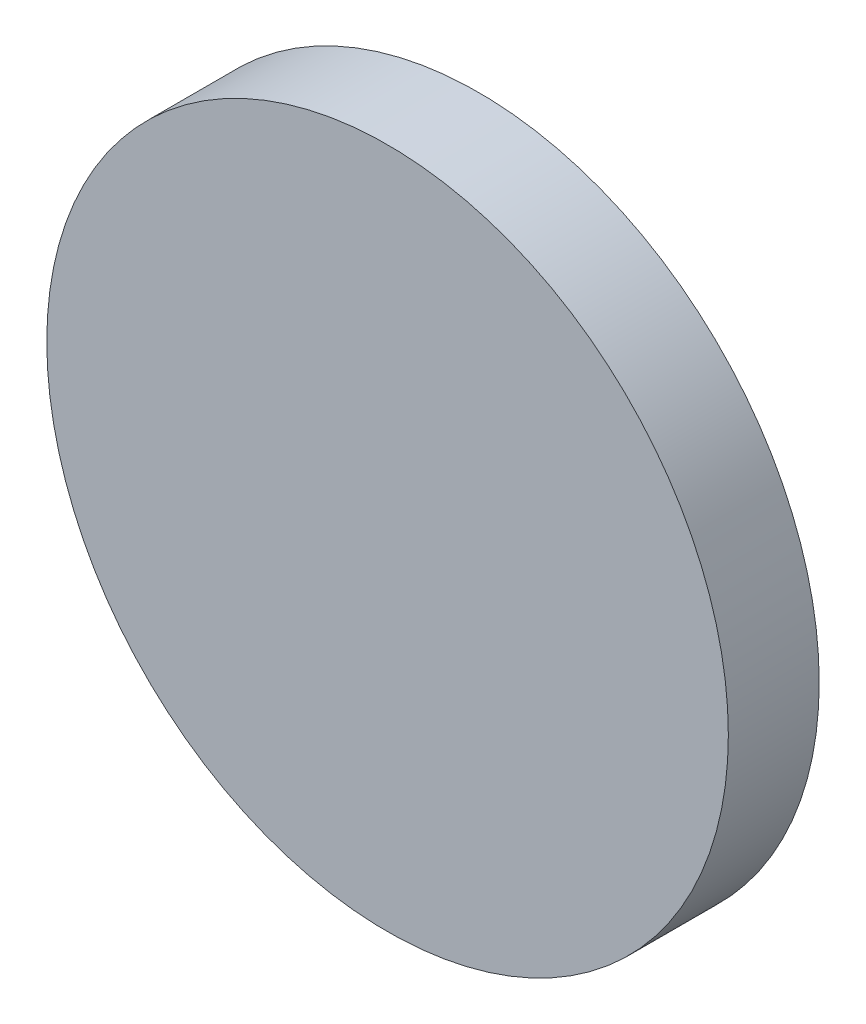
ISO-10303-21;
HEADER;
FILE_DESCRIPTION(('STEP AP214'),'2;1');
FILE_NAME('part.step','',(''),(''),'','','');
FILE_SCHEMA(('AUTOMOTIVE_DESIGN { 1 0 10303 214 1 1 1 1 }'));
ENDSEC;
DATA;
#1=APPLICATION_CONTEXT('core data for automotive mechanical design processes');
#2=APPLICATION_PROTOCOL_DEFINITION('international standard','automotive_design',2000,#1);
#3=PRODUCT_CONTEXT('',#1,'mechanical');
#4=PRODUCT('Part','Part','',(#3));
#5=PRODUCT_RELATED_PRODUCT_CATEGORY('part','',(#4));
#6=PRODUCT_DEFINITION_FORMATION('','',#4);
#7=PRODUCT_DEFINITION_CONTEXT('part definition',#1,'design');
#8=PRODUCT_DEFINITION('design','',#6,#7);
#9=PRODUCT_DEFINITION_SHAPE('','',#8);
#10=(LENGTH_UNIT() NAMED_UNIT(*) SI_UNIT(.MILLI.,.METRE.));
#11=(NAMED_UNIT(*) PLANE_ANGLE_UNIT() SI_UNIT($,.RADIAN.));
#12=(NAMED_UNIT(*) SI_UNIT($,.STERADIAN.) SOLID_ANGLE_UNIT());
#13=UNCERTAINTY_MEASURE_WITH_UNIT(LENGTH_MEASURE(1.E-05),#10,'distance_accuracy_value','');
#14=(GEOMETRIC_REPRESENTATION_CONTEXT(3) GLOBAL_UNCERTAINTY_ASSIGNED_CONTEXT((#13)) GLOBAL_UNIT_ASSIGNED_CONTEXT((#10,
#11,#12)) REPRESENTATION_CONTEXT('',''));
#15=CARTESIAN_POINT('',(0.,0.,0.));
#16=DIRECTION('',(0.,0.,1.));
#17=DIRECTION('',(1.,0.,0.));
#18=AXIS2_PLACEMENT_3D('',#15,#16,#17);
#19=CARTESIAN_POINT('',(0.,0.,20.));
#20=DIRECTION('',(0.,0.,-1.));
#21=DIRECTION('',(-1.,0.,0.));
#22=AXIS2_PLACEMENT_3D('',#19,#20,#21);
#23=CYLINDRICAL_SURFACE('',#22,75.);
#24=CARTESIAN_POINT('',(0.,0.,20.));
#25=DIRECTION('',(0.,0.,1.));
#26=DIRECTION('',(1.,0.,0.));
#27=AXIS2_PLACEMENT_3D('',#24,#25,#26);
#28=CIRCLE('',#27,75.);
#29=CARTESIAN_POINT('',(75.,0.,20.));
#30=VERTEX_POINT('',#29);
#31=EDGE_CURVE('E10',#30,#30,#28,.T.);
#32=ORIENTED_EDGE('',*,*,#31,.F.);
#33=EDGE_LOOP('',(#32));
#34=FACE_BOUND('',#33,.T.);
#35=CARTESIAN_POINT('',(0.,0.,0.));
#36=DIRECTION('',(0.,0.,1.));
#37=DIRECTION('',(1.,0.,0.));
#38=AXIS2_PLACEMENT_3D('',#35,#36,#37);
#39=CIRCLE('',#38,75.);
#40=CARTESIAN_POINT('',(75.,0.,0.));
#41=VERTEX_POINT('',#40);
#42=EDGE_CURVE('E38',#41,#41,#39,.T.);
#43=ORIENTED_EDGE('',*,*,#42,.T.);
#44=EDGE_LOOP('',(#43));
#45=FACE_BOUND('',#44,.T.);
#46=ADVANCED_FACE('F35',(#34,#45),#23,.T.);
#47=CARTESIAN_POINT('',(0.,0.,20.));
#48=DIRECTION('',(0.,0.,1.));
#49=DIRECTION('',(1.,0.,0.));
#50=AXIS2_PLACEMENT_3D('',#47,#48,#49);
#51=PLANE('',#50);
#52=ORIENTED_EDGE('',*,*,#31,.T.);
#53=EDGE_LOOP('',(#52));
#54=FACE_BOUND('',#53,.T.);
#55=ADVANCED_FACE('F50',(#54),#51,.T.);
#56=CARTESIAN_POINT('',(0.,0.,0.));
#57=DIRECTION('',(0.,0.,1.));
#58=DIRECTION('',(1.,0.,0.));
#59=AXIS2_PLACEMENT_3D('',#56,#57,#58);
#60=PLANE('',#59);
#61=ORIENTED_EDGE('',*,*,#42,.F.);
#62=EDGE_LOOP('',(#61));
#63=FACE_BOUND('',#62,.T.);
#64=ADVANCED_FACE('F48',(#63),#60,.F.);
#65=CLOSED_SHELL('',(#46,#55,#64));
#66=MANIFOLD_SOLID_BREP('B2',#65);
#67=ADVANCED_BREP_SHAPE_REPRESENTATION('',(#18,#66),#14);
#68=SHAPE_DEFINITION_REPRESENTATION(#9,#67);
ENDSEC;
END-ISO-10303-21;
